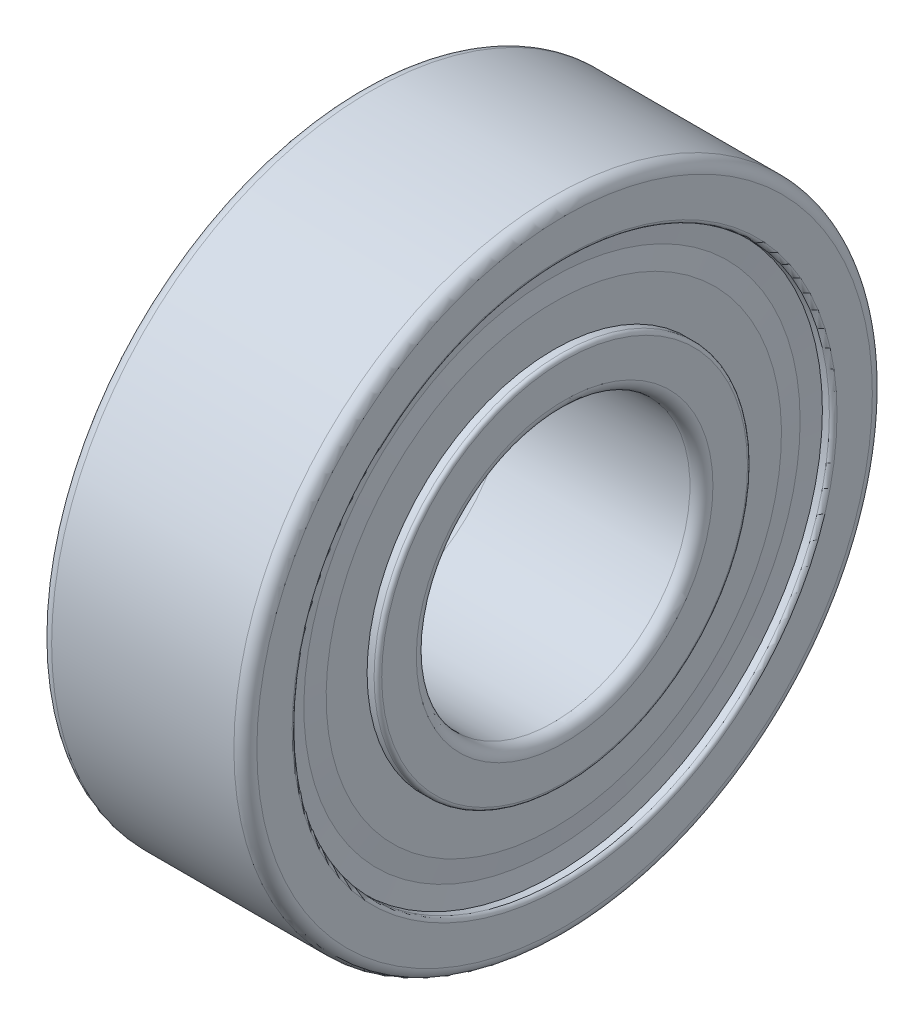
ISO-10303-21;
HEADER;
FILE_DESCRIPTION(('STEP AP214'),'2;1');
FILE_NAME('part.step','',(''),(''),'','','');
FILE_SCHEMA(('AUTOMOTIVE_DESIGN { 1 0 10303 214 1 1 1 1 }'));
ENDSEC;
DATA;
#1=APPLICATION_CONTEXT('core data for automotive mechanical design processes');
#2=APPLICATION_PROTOCOL_DEFINITION('international standard','automotive_design',2000,#1);
#3=PRODUCT_CONTEXT('',#1,'mechanical');
#4=PRODUCT('Part','Part','',(#3));
#5=PRODUCT_RELATED_PRODUCT_CATEGORY('part','',(#4));
#6=PRODUCT_DEFINITION_FORMATION('','',#4);
#7=PRODUCT_DEFINITION_CONTEXT('part definition',#1,'design');
#8=PRODUCT_DEFINITION('design','',#6,#7);
#9=PRODUCT_DEFINITION_SHAPE('','',#8);
#10=(LENGTH_UNIT() NAMED_UNIT(*) SI_UNIT(.MILLI.,.METRE.));
#11=(NAMED_UNIT(*) PLANE_ANGLE_UNIT() SI_UNIT($,.RADIAN.));
#12=(NAMED_UNIT(*) SI_UNIT($,.STERADIAN.) SOLID_ANGLE_UNIT());
#13=UNCERTAINTY_MEASURE_WITH_UNIT(LENGTH_MEASURE(1.E-05),#10,'distance_accuracy_value','');
#14=(GEOMETRIC_REPRESENTATION_CONTEXT(3) GLOBAL_UNCERTAINTY_ASSIGNED_CONTEXT((#13)) GLOBAL_UNIT_ASSIGNED_CONTEXT((#10,
#11,#12)) REPRESENTATION_CONTEXT('',''));
#15=CARTESIAN_POINT('',(0.,0.,0.));
#16=DIRECTION('',(0.,0.,1.));
#17=DIRECTION('',(1.,0.,0.));
#18=AXIS2_PLACEMENT_3D('',#15,#16,#17);
#19=CARTESIAN_POINT('',(-14.5369143589278,0.,0.));
#20=DIRECTION('',(-1.,0.,0.));
#21=DIRECTION('',(0.,0.,1.));
#22=AXIS2_PLACEMENT_3D('',#19,#20,#21);
#23=CYLINDRICAL_SURFACE('',#22,4.763);
#24=CARTESIAN_POINT('',(0.399999999999999,0.,0.));
#25=DIRECTION('',(-1.,0.,0.));
#26=DIRECTION('',(0.,0.,1.));
#27=AXIS2_PLACEMENT_3D('',#24,#25,#26);
#28=CIRCLE('',#27,4.763);
#29=CARTESIAN_POINT('',(0.399999999999999,0.,4.763));
#30=VERTEX_POINT('',#29);
#31=EDGE_CURVE('E91',#30,#30,#28,.F.);
#32=ORIENTED_EDGE('',*,*,#31,.F.);
#33=EDGE_LOOP('',(#32));
#34=FACE_BOUND('',#33,.T.);
#35=CARTESIAN_POINT('',(6.744,0.,0.));
#36=DIRECTION('',(-1.,0.,0.));
#37=DIRECTION('',(0.,0.,1.));
#38=AXIS2_PLACEMENT_3D('',#35,#36,#37);
#39=CIRCLE('',#38,4.763);
#40=CARTESIAN_POINT('',(6.744,0.,4.763));
#41=VERTEX_POINT('',#40);
#42=EDGE_CURVE('E266',#41,#41,#39,.T.);
#43=ORIENTED_EDGE('',*,*,#42,.F.);
#44=EDGE_LOOP('',(#43));
#45=FACE_BOUND('',#44,.T.);
#46=ADVANCED_FACE('F16',(#34,#45),#23,.F.);
#47=CARTESIAN_POINT('',(6.74399999999994,0.,0.));
#48=DIRECTION('',(-1.,0.,0.));
#49=DIRECTION('',(0.,0.,1.));
#50=AXIS2_PLACEMENT_3D('',#47,#48,#49);
#51=TOROIDAL_SURFACE('',#50,5.16300000000007,0.400000000000065);
#52=ORIENTED_EDGE('',*,*,#42,.T.);
#53=EDGE_LOOP('',(#52));
#54=FACE_BOUND('',#53,.T.);
#55=CARTESIAN_POINT('',(7.144,0.,0.));
#56=DIRECTION('',(1.,0.,0.));
#57=DIRECTION('',(0.,0.,1.));
#58=AXIS2_PLACEMENT_3D('',#55,#56,#57);
#59=CIRCLE('',#58,5.16300000000006);
#60=CARTESIAN_POINT('',(7.144,0.,-5.16300000000005));
#61=VERTEX_POINT('',#60);
#62=CARTESIAN_POINT('',(7.144,0.,5.16300000000005));
#63=VERTEX_POINT('',#62);
#64=EDGE_CURVE('E81',#61,#63,#59,.F.);
#65=ORIENTED_EDGE('',*,*,#64,.F.);
#66=CARTESIAN_POINT('',(7.144,0.,0.));
#67=DIRECTION('',(1.,0.,0.));
#68=DIRECTION('',(0.,0.,-1.));
#69=AXIS2_PLACEMENT_3D('',#66,#67,#68);
#70=CIRCLE('',#69,5.16300000000006);
#71=EDGE_CURVE('E79',#63,#61,#70,.F.);
#72=ORIENTED_EDGE('',*,*,#71,.F.);
#73=EDGE_LOOP('',(#65,#72));
#74=FACE_BOUND('',#73,.T.);
#75=ADVANCED_FACE('F83',(#54,#74),#51,.T.);
#76=CARTESIAN_POINT('',(0.40000000000003,0.,0.));
#77=DIRECTION('',(-1.,0.,0.));
#78=DIRECTION('',(0.,0.,1.));
#79=AXIS2_PLACEMENT_3D('',#76,#77,#78);
#80=TOROIDAL_SURFACE('',#79,5.16300000000003,0.400000000000031);
#81=CARTESIAN_POINT('',(0.,0.,0.));
#82=DIRECTION('',(-1.,0.,0.));
#83=DIRECTION('',(0.,0.,1.));
#84=AXIS2_PLACEMENT_3D('',#81,#82,#83);
#85=CIRCLE('',#84,5.16300000000002);
#86=CARTESIAN_POINT('',(0.,0.,-5.16300000000002));
#87=VERTEX_POINT('',#86);
#88=CARTESIAN_POINT('',(0.,0.,5.16300000000002));
#89=VERTEX_POINT('',#88);
#90=EDGE_CURVE('E86',#87,#89,#85,.F.);
#91=ORIENTED_EDGE('',*,*,#90,.F.);
#92=CARTESIAN_POINT('',(0.,0.,0.));
#93=DIRECTION('',(-1.,0.,0.));
#94=DIRECTION('',(0.,0.,-1.));
#95=AXIS2_PLACEMENT_3D('',#92,#93,#94);
#96=CIRCLE('',#95,5.16300000000002);
#97=EDGE_CURVE('E206',#89,#87,#96,.F.);
#98=ORIENTED_EDGE('',*,*,#97,.F.);
#99=EDGE_LOOP('',(#91,#98));
#100=FACE_BOUND('',#99,.T.);
#101=ORIENTED_EDGE('',*,*,#31,.T.);
#102=EDGE_LOOP('',(#101));
#103=FACE_BOUND('',#102,.T.);
#104=ADVANCED_FACE('F112',(#100,#103),#80,.T.);
#105=CARTESIAN_POINT('',(7.144,-6.367,0.));
#106=DIRECTION('',(1.,0.,0.));
#107=DIRECTION('',(0.,0.,-1.));
#108=AXIS2_PLACEMENT_3D('',#105,#106,#107);
#109=PLANE('',#108);
#110=CARTESIAN_POINT('',(7.144,0.,0.));
#111=DIRECTION('',(-1.,0.,0.));
#112=DIRECTION('',(0.,0.,1.));
#113=AXIS2_PLACEMENT_3D('',#110,#111,#112);
#114=CIRCLE('',#113,6.367);
#115=CARTESIAN_POINT('',(7.144,0.,6.367));
#116=VERTEX_POINT('',#115);
#117=CARTESIAN_POINT('',(7.144,0.,-6.367));
#118=VERTEX_POINT('',#117);
#119=EDGE_CURVE('E218',#116,#118,#114,.T.);
#120=ORIENTED_EDGE('',*,*,#119,.F.);
#121=CARTESIAN_POINT('',(7.144,0.,0.));
#122=DIRECTION('',(-1.,0.,0.));
#123=DIRECTION('',(0.,0.,-1.));
#124=AXIS2_PLACEMENT_3D('',#121,#122,#123);
#125=CIRCLE('',#124,6.367);
#126=EDGE_CURVE('E136',#118,#116,#125,.T.);
#127=ORIENTED_EDGE('',*,*,#126,.F.);
#128=EDGE_LOOP('',(#120,#127));
#129=FACE_BOUND('',#128,.T.);
#130=ORIENTED_EDGE('',*,*,#71,.T.);
#131=ORIENTED_EDGE('',*,*,#64,.T.);
#132=EDGE_LOOP('',(#130,#131));
#133=FACE_BOUND('',#132,.T.);
#134=ADVANCED_FACE('F90',(#129,#133),#109,.T.);
#135=CARTESIAN_POINT('',(0.,-5.163,0.));
#136=DIRECTION('',(-1.,0.,0.));
#137=DIRECTION('',(0.,0.,1.));
#138=AXIS2_PLACEMENT_3D('',#135,#136,#137);
#139=PLANE('',#138);
#140=ORIENTED_EDGE('',*,*,#90,.T.);
#141=ORIENTED_EDGE('',*,*,#97,.T.);
#142=EDGE_LOOP('',(#140,#141));
#143=FACE_BOUND('',#142,.T.);
#144=CARTESIAN_POINT('',(0.,0.,0.));
#145=DIRECTION('',(1.,0.,0.));
#146=DIRECTION('',(0.,0.,-1.));
#147=AXIS2_PLACEMENT_3D('',#144,#145,#146);
#148=CIRCLE('',#147,6.367);
#149=CARTESIAN_POINT('',(0.,0.,-6.367));
#150=VERTEX_POINT('',#149);
#151=CARTESIAN_POINT('',(0.,0.,6.367));
#152=VERTEX_POINT('',#151);
#153=EDGE_CURVE('E173',#150,#152,#148,.T.);
#154=ORIENTED_EDGE('',*,*,#153,.F.);
#155=CARTESIAN_POINT('',(0.,0.,0.));
#156=DIRECTION('',(1.,0.,0.));
#157=DIRECTION('',(0.,0.,1.));
#158=AXIS2_PLACEMENT_3D('',#155,#156,#157);
#159=CIRCLE('',#158,6.36699999999999);
#160=EDGE_CURVE('E184',#152,#150,#159,.T.);
#161=ORIENTED_EDGE('',*,*,#160,.F.);
#162=EDGE_LOOP('',(#154,#161));
#163=FACE_BOUND('',#162,.T.);
#164=ADVANCED_FACE('F111',(#143,#163),#139,.T.);
#165=CARTESIAN_POINT('',(7.01099999999997,0.,0.));
#166=DIRECTION('',(-1.,0.,0.));
#167=DIRECTION('',(0.,0.,1.));
#168=AXIS2_PLACEMENT_3D('',#165,#166,#167);
#169=TOROIDAL_SURFACE('',#168,6.36699999999996,0.133000000000035);
#170=ORIENTED_EDGE('',*,*,#119,.T.);
#171=ORIENTED_EDGE('',*,*,#126,.T.);
#172=EDGE_LOOP('',(#170,#171));
#173=FACE_BOUND('',#172,.T.);
#174=CARTESIAN_POINT('',(7.011,0.,0.));
#175=DIRECTION('',(-1.,0.,0.));
#176=DIRECTION('',(0.,0.,1.));
#177=AXIS2_PLACEMENT_3D('',#174,#175,#176);
#178=CIRCLE('',#177,6.5);
#179=CARTESIAN_POINT('',(7.011,0.,6.5));
#180=VERTEX_POINT('',#179);
#181=EDGE_CURVE('E168',#180,#180,#178,.T.);
#182=ORIENTED_EDGE('',*,*,#181,.F.);
#183=EDGE_LOOP('',(#182));
#184=FACE_BOUND('',#183,.T.);
#185=ADVANCED_FACE('F151',(#173,#184),#169,.T.);
#186=CARTESIAN_POINT('',(0.133000000000018,0.,0.));
#187=DIRECTION('',(-1.,0.,0.));
#188=DIRECTION('',(0.,0.,1.));
#189=AXIS2_PLACEMENT_3D('',#186,#187,#188);
#190=TOROIDAL_SURFACE('',#189,6.36699999999998,0.133000000000018);
#191=CARTESIAN_POINT('',(0.132999999999999,0.,0.));
#192=DIRECTION('',(-1.,0.,0.));
#193=DIRECTION('',(0.,0.,1.));
#194=AXIS2_PLACEMENT_3D('',#191,#192,#193);
#195=CIRCLE('',#194,6.5);
#196=CARTESIAN_POINT('',(0.132999999999999,0.,6.5));
#197=VERTEX_POINT('',#196);
#198=EDGE_CURVE('E217',#197,#197,#195,.F.);
#199=ORIENTED_EDGE('',*,*,#198,.F.);
#200=EDGE_LOOP('',(#199));
#201=FACE_BOUND('',#200,.T.);
#202=ORIENTED_EDGE('',*,*,#160,.T.);
#203=ORIENTED_EDGE('',*,*,#153,.T.);
#204=EDGE_LOOP('',(#202,#203));
#205=FACE_BOUND('',#204,.T.);
#206=ADVANCED_FACE('F160',(#201,#205),#190,.T.);
#207=CARTESIAN_POINT('',(-14.5369143589278,0.,0.));
#208=DIRECTION('',(-1.,0.,0.));
#209=DIRECTION('',(0.,0.,1.));
#210=AXIS2_PLACEMENT_3D('',#207,#208,#209);
#211=CYLINDRICAL_SURFACE('',#210,6.5);
#212=ORIENTED_EDGE('',*,*,#181,.T.);
#213=EDGE_LOOP('',(#212));
#214=FACE_BOUND('',#213,.T.);
#215=CARTESIAN_POINT('',(6.768,0.,0.));
#216=DIRECTION('',(-1.,0.,0.));
#217=DIRECTION('',(0.,0.,1.));
#218=AXIS2_PLACEMENT_3D('',#215,#216,#217);
#219=CIRCLE('',#218,6.5);
#220=CARTESIAN_POINT('',(6.768,0.,6.5));
#221=VERTEX_POINT('',#220);
#222=EDGE_CURVE('E279',#221,#221,#219,.T.);
#223=ORIENTED_EDGE('',*,*,#222,.F.);
#224=EDGE_LOOP('',(#223));
#225=FACE_BOUND('',#224,.T.);
#226=ADVANCED_FACE('F501',(#214,#225),#211,.T.);
#227=CARTESIAN_POINT('',(-14.5369143589278,0.,0.));
#228=DIRECTION('',(-1.,0.,0.));
#229=DIRECTION('',(0.,0.,1.));
#230=AXIS2_PLACEMENT_3D('',#227,#228,#229);
#231=CYLINDRICAL_SURFACE('',#230,6.5);
#232=CARTESIAN_POINT('',(0.376,0.,0.));
#233=DIRECTION('',(-1.,0.,0.));
#234=DIRECTION('',(0.,0.,1.));
#235=AXIS2_PLACEMENT_3D('',#232,#233,#234);
#236=CIRCLE('',#235,6.5);
#237=CARTESIAN_POINT('',(0.376,0.,6.5));
#238=VERTEX_POINT('',#237);
#239=EDGE_CURVE('E276',#238,#238,#236,.F.);
#240=ORIENTED_EDGE('',*,*,#239,.F.);
#241=EDGE_LOOP('',(#240));
#242=FACE_BOUND('',#241,.T.);
#243=ORIENTED_EDGE('',*,*,#198,.T.);
#244=EDGE_LOOP('',(#243));
#245=FACE_BOUND('',#244,.T.);
#246=ADVANCED_FACE('F498',(#242,#245),#231,.T.);
#247=CARTESIAN_POINT('',(6.768,-7.925,0.));
#248=DIRECTION('',(1.,0.,0.));
#249=DIRECTION('',(0.,0.,-1.));
#250=AXIS2_PLACEMENT_3D('',#247,#248,#249);
#251=PLANE('',#250);
#252=CARTESIAN_POINT('',(6.768,0.,0.));
#253=DIRECTION('',(-1.,0.,0.));
#254=DIRECTION('',(0.,-1.,0.));
#255=AXIS2_PLACEMENT_3D('',#252,#253,#254);
#256=CIRCLE('',#255,7.925);
#257=CARTESIAN_POINT('',(6.768,-7.925,0.));
#258=VERTEX_POINT('',#257);
#259=EDGE_CURVE('E273',#258,#258,#256,.T.);
#260=ORIENTED_EDGE('',*,*,#259,.F.);
#261=EDGE_LOOP('',(#260));
#262=FACE_BOUND('',#261,.T.);
#263=ORIENTED_EDGE('',*,*,#222,.T.);
#264=EDGE_LOOP('',(#263));
#265=FACE_BOUND('',#264,.T.);
#266=ADVANCED_FACE('F596',(#262,#265),#251,.T.);
#267=CARTESIAN_POINT('',(0.376,-6.5,0.));
#268=DIRECTION('',(-1.,0.,0.));
#269=DIRECTION('',(0.,0.,1.));
#270=AXIS2_PLACEMENT_3D('',#267,#268,#269);
#271=PLANE('',#270);
#272=ORIENTED_EDGE('',*,*,#239,.T.);
#273=EDGE_LOOP('',(#272));
#274=FACE_BOUND('',#273,.T.);
#275=CARTESIAN_POINT('',(0.376,0.,0.));
#276=DIRECTION('',(1.,0.,0.));
#277=DIRECTION('',(0.,1.,0.));
#278=AXIS2_PLACEMENT_3D('',#275,#276,#277);
#279=CIRCLE('',#278,7.925);
#280=CARTESIAN_POINT('',(0.376,7.925,0.));
#281=VERTEX_POINT('',#280);
#282=EDGE_CURVE('E269',#281,#281,#279,.T.);
#283=ORIENTED_EDGE('',*,*,#282,.F.);
#284=EDGE_LOOP('',(#283));
#285=FACE_BOUND('',#284,.T.);
#286=ADVANCED_FACE('F588',(#274,#285),#271,.T.);
#287=CARTESIAN_POINT('',(6.70525,0.,0.));
#288=DIRECTION('',(-1.,0.,0.));
#289=DIRECTION('',(0.,-1.,0.));
#290=AXIS2_PLACEMENT_3D('',#287,#288,#289);
#291=CONICAL_SURFACE('',#290,8.6375,1.48295279871847);
#292=ORIENTED_EDGE('',*,*,#259,.T.);
#293=EDGE_LOOP('',(#292));
#294=FACE_BOUND('',#293,.T.);
#295=CARTESIAN_POINT('',(6.70525,0.,0.));
#296=DIRECTION('',(1.,0.,0.));
#297=DIRECTION('',(0.,0.,-1.));
#298=AXIS2_PLACEMENT_3D('',#295,#296,#297);
#299=CIRCLE('',#298,8.6375);
#300=CARTESIAN_POINT('',(6.70525,0.,-8.6375));
#301=VERTEX_POINT('',#300);
#302=EDGE_CURVE('E272',#301,#301,#299,.T.);
#303=ORIENTED_EDGE('',*,*,#302,.T.);
#304=EDGE_LOOP('',(#303));
#305=FACE_BOUND('',#304,.T.);
#306=ADVANCED_FACE('F580',(#294,#305),#291,.T.);
#307=CARTESIAN_POINT('',(0.43875,0.,0.));
#308=DIRECTION('',(1.,0.,0.));
#309=DIRECTION('',(0.,1.,0.));
#310=AXIS2_PLACEMENT_3D('',#307,#308,#309);
#311=CONICAL_SURFACE('',#310,8.6375,1.48295279871847);
#312=ORIENTED_EDGE('',*,*,#282,.T.);
#313=EDGE_LOOP('',(#312));
#314=FACE_BOUND('',#313,.T.);
#315=CARTESIAN_POINT('',(0.43875,0.,0.));
#316=DIRECTION('',(-1.,0.,0.));
#317=DIRECTION('',(0.,0.,1.));
#318=AXIS2_PLACEMENT_3D('',#315,#316,#317);
#319=CIRCLE('',#318,8.6375);
#320=CARTESIAN_POINT('',(0.43875,0.,8.6375));
#321=VERTEX_POINT('',#320);
#322=EDGE_CURVE('E490',#321,#321,#319,.T.);
#323=ORIENTED_EDGE('',*,*,#322,.T.);
#324=EDGE_LOOP('',(#323));
#325=FACE_BOUND('',#324,.T.);
#326=ADVANCED_FACE('F572',(#314,#325),#311,.T.);
#327=CARTESIAN_POINT('',(6.768,0.,0.));
#328=DIRECTION('',(1.,0.,0.));
#329=DIRECTION('',(0.,0.,-1.));
#330=AXIS2_PLACEMENT_3D('',#327,#328,#329);
#331=CONICAL_SURFACE('',#330,9.35,1.48295279871847);
#332=CARTESIAN_POINT('',(6.768,0.,0.));
#333=DIRECTION('',(-1.,0.,0.));
#334=DIRECTION('',(0.,0.,1.));
#335=AXIS2_PLACEMENT_3D('',#332,#333,#334);
#336=CIRCLE('',#335,9.35);
#337=CARTESIAN_POINT('',(6.768,0.,9.35));
#338=VERTEX_POINT('',#337);
#339=EDGE_CURVE('E487',#338,#338,#336,.F.);
#340=ORIENTED_EDGE('',*,*,#339,.T.);
#341=EDGE_LOOP('',(#340));
#342=FACE_BOUND('',#341,.T.);
#343=ORIENTED_EDGE('',*,*,#302,.F.);
#344=EDGE_LOOP('',(#343));
#345=FACE_BOUND('',#344,.T.);
#346=ADVANCED_FACE('F564',(#342,#345),#331,.F.);
#347=CARTESIAN_POINT('',(0.375999999999999,0.,0.));
#348=DIRECTION('',(-1.,0.,0.));
#349=DIRECTION('',(0.,0.,1.));
#350=AXIS2_PLACEMENT_3D('',#347,#348,#349);
#351=CONICAL_SURFACE('',#350,9.35,1.48295279871847);
#352=CARTESIAN_POINT('',(0.376,0.,0.));
#353=DIRECTION('',(-1.,0.,0.));
#354=DIRECTION('',(0.,0.,1.));
#355=AXIS2_PLACEMENT_3D('',#352,#353,#354);
#356=CIRCLE('',#355,9.35);
#357=CARTESIAN_POINT('',(0.376,0.,9.35));
#358=VERTEX_POINT('',#357);
#359=EDGE_CURVE('E482',#358,#358,#356,.T.);
#360=ORIENTED_EDGE('',*,*,#359,.T.);
#361=EDGE_LOOP('',(#360));
#362=FACE_BOUND('',#361,.T.);
#363=ORIENTED_EDGE('',*,*,#322,.F.);
#364=EDGE_LOOP('',(#363));
#365=FACE_BOUND('',#364,.T.);
#366=ADVANCED_FACE('F557',(#362,#365),#351,.F.);
#367=CARTESIAN_POINT('',(-14.5369143589278,0.,0.));
#368=DIRECTION('',(-1.,0.,0.));
#369=DIRECTION('',(0.,0.,1.));
#370=AXIS2_PLACEMENT_3D('',#367,#368,#369);
#371=CYLINDRICAL_SURFACE('',#370,9.35);
#372=ORIENTED_EDGE('',*,*,#339,.F.);
#373=EDGE_LOOP('',(#372));
#374=FACE_BOUND('',#373,.T.);
#375=CARTESIAN_POINT('',(7.011,0.,0.));
#376=DIRECTION('',(-1.,0.,0.));
#377=DIRECTION('',(0.,0.,1.));
#378=AXIS2_PLACEMENT_3D('',#375,#376,#377);
#379=CIRCLE('',#378,9.35);
#380=CARTESIAN_POINT('',(7.011,0.,9.35));
#381=VERTEX_POINT('',#380);
#382=EDGE_CURVE('E479',#381,#381,#379,.T.);
#383=ORIENTED_EDGE('',*,*,#382,.F.);
#384=EDGE_LOOP('',(#383));
#385=FACE_BOUND('',#384,.T.);
#386=ADVANCED_FACE('F550',(#374,#385),#371,.F.);
#387=CARTESIAN_POINT('',(-14.5369143589278,0.,0.));
#388=DIRECTION('',(-1.,0.,0.));
#389=DIRECTION('',(0.,0.,1.));
#390=AXIS2_PLACEMENT_3D('',#387,#388,#389);
#391=CYLINDRICAL_SURFACE('',#390,9.35);
#392=CARTESIAN_POINT('',(0.132999999999999,0.,0.));
#393=DIRECTION('',(-1.,0.,0.));
#394=DIRECTION('',(0.,0.,1.));
#395=AXIS2_PLACEMENT_3D('',#392,#393,#394);
#396=CIRCLE('',#395,9.35);
#397=CARTESIAN_POINT('',(0.132999999999999,0.,9.35));
#398=VERTEX_POINT('',#397);
#399=EDGE_CURVE('E477',#398,#398,#396,.F.);
#400=ORIENTED_EDGE('',*,*,#399,.F.);
#401=EDGE_LOOP('',(#400));
#402=FACE_BOUND('',#401,.T.);
#403=ORIENTED_EDGE('',*,*,#359,.F.);
#404=EDGE_LOOP('',(#403));
#405=FACE_BOUND('',#404,.T.);
#406=ADVANCED_FACE('F442',(#402,#405),#391,.F.);
#407=CARTESIAN_POINT('',(7.01099999999997,0.,0.));
#408=DIRECTION('',(-1.,0.,0.));
#409=DIRECTION('',(0.,0.,1.));
#410=AXIS2_PLACEMENT_3D('',#407,#408,#409);
#411=TOROIDAL_SURFACE('',#410,9.48300000000004,0.133000000000035);
#412=ORIENTED_EDGE('',*,*,#382,.T.);
#413=EDGE_LOOP('',(#412));
#414=FACE_BOUND('',#413,.T.);
#415=CARTESIAN_POINT('',(7.144,0.,0.));
#416=DIRECTION('',(1.,0.,0.));
#417=DIRECTION('',(0.,0.,1.));
#418=AXIS2_PLACEMENT_3D('',#415,#416,#417);
#419=CIRCLE('',#418,9.48300000000003);
#420=CARTESIAN_POINT('',(7.144,0.,-9.48300000000002));
#421=VERTEX_POINT('',#420);
#422=CARTESIAN_POINT('',(7.144,0.,9.48300000000002));
#423=VERTEX_POINT('',#422);
#424=EDGE_CURVE('E476',#421,#423,#419,.F.);
#425=ORIENTED_EDGE('',*,*,#424,.F.);
#426=CARTESIAN_POINT('',(7.144,0.,0.));
#427=DIRECTION('',(1.,0.,0.));
#428=DIRECTION('',(0.,0.,-1.));
#429=AXIS2_PLACEMENT_3D('',#426,#427,#428);
#430=CIRCLE('',#429,9.48300000000003);
#431=EDGE_CURVE('E370',#423,#421,#430,.F.);
#432=ORIENTED_EDGE('',*,*,#431,.F.);
#433=EDGE_LOOP('',(#425,#432));
#434=FACE_BOUND('',#433,.T.);
#435=ADVANCED_FACE('F438',(#414,#434),#411,.T.);
#436=CARTESIAN_POINT('',(0.133000000000018,0.,0.));
#437=DIRECTION('',(-1.,0.,0.));
#438=DIRECTION('',(0.,0.,1.));
#439=AXIS2_PLACEMENT_3D('',#436,#437,#438);
#440=TOROIDAL_SURFACE('',#439,9.48300000000002,0.133000000000017);
#441=CARTESIAN_POINT('',(0.,0.,0.));
#442=DIRECTION('',(-1.,0.,0.));
#443=DIRECTION('',(0.,0.,1.));
#444=AXIS2_PLACEMENT_3D('',#441,#442,#443);
#445=CIRCLE('',#444,9.48300000000002);
#446=CARTESIAN_POINT('',(0.,0.,-9.48300000000002));
#447=VERTEX_POINT('',#446);
#448=CARTESIAN_POINT('',(0.,0.,9.48300000000002));
#449=VERTEX_POINT('',#448);
#450=EDGE_CURVE('E338',#447,#449,#445,.F.);
#451=ORIENTED_EDGE('',*,*,#450,.F.);
#452=CARTESIAN_POINT('',(0.,0.,0.));
#453=DIRECTION('',(-1.,0.,0.));
#454=DIRECTION('',(0.,0.,-1.));
#455=AXIS2_PLACEMENT_3D('',#452,#453,#454);
#456=CIRCLE('',#455,9.48300000000002);
#457=EDGE_CURVE('E348',#449,#447,#456,.F.);
#458=ORIENTED_EDGE('',*,*,#457,.F.);
#459=EDGE_LOOP('',(#451,#458));
#460=FACE_BOUND('',#459,.T.);
#461=ORIENTED_EDGE('',*,*,#399,.T.);
#462=EDGE_LOOP('',(#461));
#463=FACE_BOUND('',#462,.T.);
#464=ADVANCED_FACE('F384',(#460,#463),#440,.T.);
#465=CARTESIAN_POINT('',(7.144,-10.713,0.));
#466=DIRECTION('',(1.,0.,0.));
#467=DIRECTION('',(0.,0.,-1.));
#468=AXIS2_PLACEMENT_3D('',#465,#466,#467);
#469=PLANE('',#468);
#470=CARTESIAN_POINT('',(7.144,0.,0.));
#471=DIRECTION('',(-1.,0.,0.));
#472=DIRECTION('',(0.,0.,1.));
#473=AXIS2_PLACEMENT_3D('',#470,#471,#472);
#474=CIRCLE('',#473,10.713);
#475=CARTESIAN_POINT('',(7.144,0.,10.7130000000001));
#476=VERTEX_POINT('',#475);
#477=CARTESIAN_POINT('',(7.144,0.,-10.7130000000001));
#478=VERTEX_POINT('',#477);
#479=EDGE_CURVE('E285',#476,#478,#474,.T.);
#480=ORIENTED_EDGE('',*,*,#479,.F.);
#481=CARTESIAN_POINT('',(7.144,0.,0.));
#482=DIRECTION('',(-1.,0.,0.));
#483=DIRECTION('',(0.,0.,-1.));
#484=AXIS2_PLACEMENT_3D('',#481,#482,#483);
#485=CIRCLE('',#484,10.7130000000003);
#486=EDGE_CURVE('E405',#478,#476,#485,.T.);
#487=ORIENTED_EDGE('',*,*,#486,.F.);
#488=EDGE_LOOP('',(#480,#487));
#489=FACE_BOUND('',#488,.T.);
#490=ORIENTED_EDGE('',*,*,#431,.T.);
#491=ORIENTED_EDGE('',*,*,#424,.T.);
#492=EDGE_LOOP('',(#490,#491));
#493=FACE_BOUND('',#492,.T.);
#494=ADVANCED_FACE('F375',(#489,#493),#469,.T.);
#495=CARTESIAN_POINT('',(0.,-9.48300000000001,0.));
#496=DIRECTION('',(-1.,0.,0.));
#497=DIRECTION('',(0.,0.,1.));
#498=AXIS2_PLACEMENT_3D('',#495,#496,#497);
#499=PLANE('',#498);
#500=ORIENTED_EDGE('',*,*,#450,.T.);
#501=ORIENTED_EDGE('',*,*,#457,.T.);
#502=EDGE_LOOP('',(#500,#501));
#503=FACE_BOUND('',#502,.T.);
#504=CARTESIAN_POINT('',(0.,0.,0.));
#505=DIRECTION('',(1.,0.,0.));
#506=DIRECTION('',(0.,0.,-1.));
#507=AXIS2_PLACEMENT_3D('',#504,#505,#506);
#508=CIRCLE('',#507,10.7130000000003);
#509=CARTESIAN_POINT('',(0.,0.,10.7130000000002));
#510=VERTEX_POINT('',#509);
#511=CARTESIAN_POINT('',(0.,0.,-10.7130000000002));
#512=VERTEX_POINT('',#511);
#513=EDGE_CURVE('E34',#510,#512,#508,.F.);
#514=ORIENTED_EDGE('',*,*,#513,.T.);
#515=CARTESIAN_POINT('',(0.,0.,0.));
#516=DIRECTION('',(1.,0.,0.));
#517=DIRECTION('',(0.,0.,1.));
#518=AXIS2_PLACEMENT_3D('',#515,#516,#517);
#519=CIRCLE('',#518,10.7130000000003);
#520=EDGE_CURVE('E325',#510,#512,#519,.T.);
#521=ORIENTED_EDGE('',*,*,#520,.F.);
#522=EDGE_LOOP('',(#514,#521));
#523=FACE_BOUND('',#522,.T.);
#524=ADVANCED_FACE('F303',(#503,#523),#499,.T.);
#525=CARTESIAN_POINT('',(6.74400000000062,0.,0.));
#526=DIRECTION('',(-1.,0.,0.));
#527=DIRECTION('',(0.,0.,1.));
#528=AXIS2_PLACEMENT_3D('',#525,#526,#527);
#529=TOROIDAL_SURFACE('',#528,10.7130000000006,0.399999999999381);
#530=ORIENTED_EDGE('',*,*,#479,.T.);
#531=ORIENTED_EDGE('',*,*,#486,.T.);
#532=EDGE_LOOP('',(#530,#531));
#533=FACE_BOUND('',#532,.T.);
#534=CARTESIAN_POINT('',(6.744,0.,0.));
#535=DIRECTION('',(-1.,0.,0.));
#536=DIRECTION('',(0.,0.,1.));
#537=AXIS2_PLACEMENT_3D('',#534,#535,#536);
#538=CIRCLE('',#537,11.113);
#539=CARTESIAN_POINT('',(6.744,0.,11.113));
#540=VERTEX_POINT('',#539);
#541=EDGE_CURVE('E26',#540,#540,#538,.T.);
#542=ORIENTED_EDGE('',*,*,#541,.F.);
#543=EDGE_LOOP('',(#542));
#544=FACE_BOUND('',#543,.T.);
#545=ADVANCED_FACE('F291',(#533,#544),#529,.T.);
#546=CARTESIAN_POINT('',(0.399999999999349,0.,0.));
#547=DIRECTION('',(-1.,0.,0.));
#548=DIRECTION('',(0.,0.,1.));
#549=AXIS2_PLACEMENT_3D('',#546,#547,#548);
#550=TOROIDAL_SURFACE('',#549,10.7130000000007,0.399999999999348);
#551=ORIENTED_EDGE('',*,*,#520,.T.);
#552=ORIENTED_EDGE('',*,*,#513,.F.);
#553=EDGE_LOOP('',(#551,#552));
#554=FACE_BOUND('',#553,.T.);
#555=CARTESIAN_POINT('',(0.399999999999999,0.,0.));
#556=DIRECTION('',(-1.,0.,0.));
#557=DIRECTION('',(0.,0.,1.));
#558=AXIS2_PLACEMENT_3D('',#555,#556,#557);
#559=CIRCLE('',#558,11.113);
#560=CARTESIAN_POINT('',(0.399999999999999,0.,11.113));
#561=VERTEX_POINT('',#560);
#562=EDGE_CURVE('E11',#561,#561,#559,.F.);
#563=ORIENTED_EDGE('',*,*,#562,.F.);
#564=EDGE_LOOP('',(#563));
#565=FACE_BOUND('',#564,.T.);
#566=ADVANCED_FACE('F302',(#554,#565),#550,.T.);
#567=CARTESIAN_POINT('',(-14.5369143589278,0.,0.));
#568=DIRECTION('',(-1.,0.,0.));
#569=DIRECTION('',(0.,0.,1.));
#570=AXIS2_PLACEMENT_3D('',#567,#568,#569);
#571=CYLINDRICAL_SURFACE('',#570,11.113);
#572=ORIENTED_EDGE('',*,*,#541,.T.);
#573=EDGE_LOOP('',(#572));
#574=FACE_BOUND('',#573,.T.);
#575=ORIENTED_EDGE('',*,*,#562,.T.);
#576=EDGE_LOOP('',(#575));
#577=FACE_BOUND('',#576,.T.);
#578=ADVANCED_FACE('F507',(#574,#577),#571,.T.);
#579=CLOSED_SHELL('',(#46,#75,#104,#134,#164,#185,#206,#226,#246,#266,#286,#306,#326,#346,#366,
#386,#406,#435,#464,#494,#524,#545,#566,#578));
#580=MANIFOLD_SOLID_BREP('B1',#579);
#581=ADVANCED_BREP_SHAPE_REPRESENTATION('',(#18,#580),#14);
#582=SHAPE_DEFINITION_REPRESENTATION(#9,#581);
ENDSEC;
END-ISO-10303-21;
